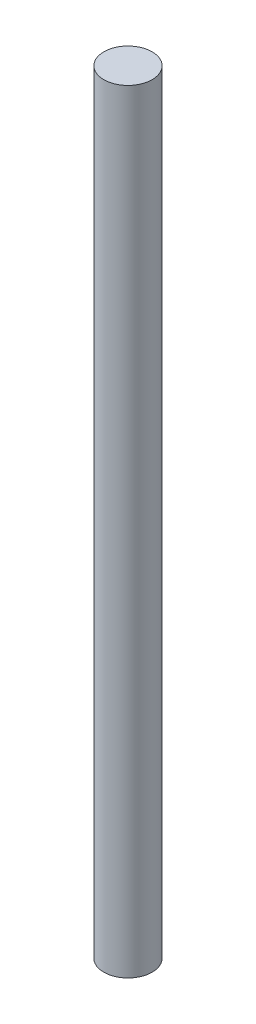
ISO-10303-21;
HEADER;
FILE_DESCRIPTION(('STEP AP214'),'2;1');
FILE_NAME('part.step','',(''),(''),'','','');
FILE_SCHEMA(('AUTOMOTIVE_DESIGN { 1 0 10303 214 1 1 1 1 }'));
ENDSEC;
DATA;
#1=APPLICATION_CONTEXT('core data for automotive mechanical design processes');
#2=APPLICATION_PROTOCOL_DEFINITION('international standard','automotive_design',2000,#1);
#3=PRODUCT_CONTEXT('',#1,'mechanical');
#4=PRODUCT('Part','Part','',(#3));
#5=PRODUCT_RELATED_PRODUCT_CATEGORY('part','',(#4));
#6=PRODUCT_DEFINITION_FORMATION('','',#4);
#7=PRODUCT_DEFINITION_CONTEXT('part definition',#1,'design');
#8=PRODUCT_DEFINITION('design','',#6,#7);
#9=PRODUCT_DEFINITION_SHAPE('','',#8);
#10=(LENGTH_UNIT() NAMED_UNIT(*) SI_UNIT(.MILLI.,.METRE.));
#11=(NAMED_UNIT(*) PLANE_ANGLE_UNIT() SI_UNIT($,.RADIAN.));
#12=(NAMED_UNIT(*) SI_UNIT($,.STERADIAN.) SOLID_ANGLE_UNIT());
#13=UNCERTAINTY_MEASURE_WITH_UNIT(LENGTH_MEASURE(1.E-05),#10,'distance_accuracy_value','');
#14=(GEOMETRIC_REPRESENTATION_CONTEXT(3) GLOBAL_UNCERTAINTY_ASSIGNED_CONTEXT((#13)) GLOBAL_UNIT_ASSIGNED_CONTEXT((#10,
#11,#12)) REPRESENTATION_CONTEXT('',''));
#15=CARTESIAN_POINT('',(0.,0.,0.));
#16=DIRECTION('',(0.,0.,1.));
#17=DIRECTION('',(1.,0.,0.));
#18=AXIS2_PLACEMENT_3D('',#15,#16,#17);
#19=CARTESIAN_POINT('',(0.,20.32,0.));
#20=DIRECTION('',(0.,-1.,0.));
#21=DIRECTION('',(0.,0.,-1.));
#22=AXIS2_PLACEMENT_3D('',#19,#20,#21);
#23=CYLINDRICAL_SURFACE('',#22,1.27);
#24=CARTESIAN_POINT('',(0.,20.32,0.));
#25=DIRECTION('',(0.,1.,0.));
#26=DIRECTION('',(0.,0.,1.));
#27=AXIS2_PLACEMENT_3D('',#24,#25,#26);
#28=CIRCLE('',#27,1.27);
#29=CARTESIAN_POINT('',(0.,20.32,1.27));
#30=VERTEX_POINT('',#29);
#31=EDGE_CURVE('E10',#30,#30,#28,.T.);
#32=ORIENTED_EDGE('',*,*,#31,.F.);
#33=EDGE_LOOP('',(#32));
#34=FACE_BOUND('',#33,.T.);
#35=CARTESIAN_POINT('',(0.,-20.32,0.));
#36=DIRECTION('',(0.,1.,0.));
#37=DIRECTION('',(0.,0.,1.));
#38=AXIS2_PLACEMENT_3D('',#35,#36,#37);
#39=CIRCLE('',#38,1.27);
#40=CARTESIAN_POINT('',(0.,-20.32,1.27));
#41=VERTEX_POINT('',#40);
#42=EDGE_CURVE('E33',#41,#41,#39,.T.);
#43=ORIENTED_EDGE('',*,*,#42,.T.);
#44=EDGE_LOOP('',(#43));
#45=FACE_BOUND('',#44,.T.);
#46=ADVANCED_FACE('F30',(#34,#45),#23,.T.);
#47=CARTESIAN_POINT('',(0.,20.32,0.));
#48=DIRECTION('',(0.,1.,0.));
#49=DIRECTION('',(0.,0.,1.));
#50=AXIS2_PLACEMENT_3D('',#47,#48,#49);
#51=PLANE('',#50);
#52=ORIENTED_EDGE('',*,*,#31,.T.);
#53=EDGE_LOOP('',(#52));
#54=FACE_BOUND('',#53,.T.);
#55=ADVANCED_FACE('F45',(#54),#51,.T.);
#56=CARTESIAN_POINT('',(0.,-20.32,0.));
#57=DIRECTION('',(0.,1.,0.));
#58=DIRECTION('',(0.,0.,1.));
#59=AXIS2_PLACEMENT_3D('',#56,#57,#58);
#60=PLANE('',#59);
#61=ORIENTED_EDGE('',*,*,#42,.F.);
#62=EDGE_LOOP('',(#61));
#63=FACE_BOUND('',#62,.T.);
#64=ADVANCED_FACE('F43',(#63),#60,.F.);
#65=CLOSED_SHELL('',(#46,#55,#64));
#66=MANIFOLD_SOLID_BREP('B2',#65);
#67=ADVANCED_BREP_SHAPE_REPRESENTATION('',(#18,#66),#14);
#68=SHAPE_DEFINITION_REPRESENTATION(#9,#67);
ENDSEC;
END-ISO-10303-21;
